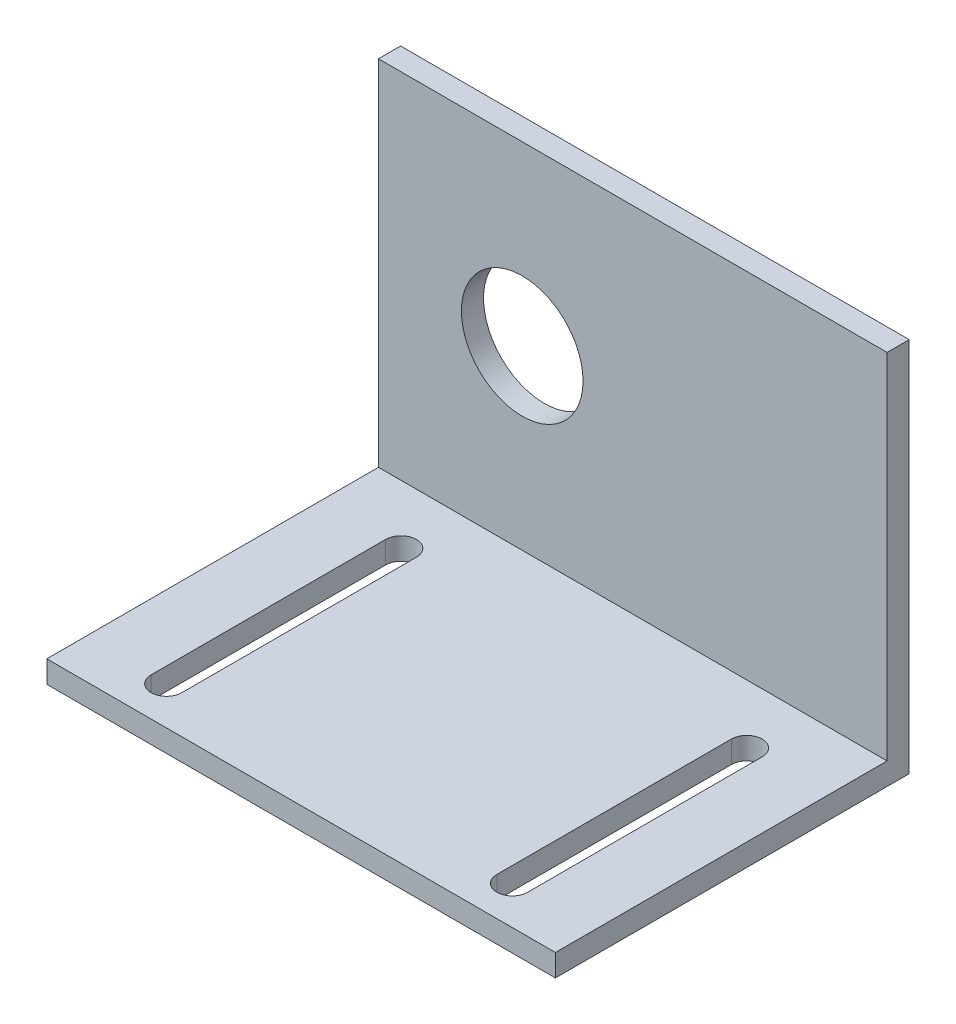
ISO-10303-21;
HEADER;
FILE_DESCRIPTION(('STEP AP214'),'2;1');
FILE_NAME('part.step','',(''),(''),'','','');
FILE_SCHEMA(('AUTOMOTIVE_DESIGN { 1 0 10303 214 1 1 1 1 }'));
ENDSEC;
DATA;
#1=APPLICATION_CONTEXT('core data for automotive mechanical design processes');
#2=APPLICATION_PROTOCOL_DEFINITION('international standard','automotive_design',2000,#1);
#3=PRODUCT_CONTEXT('',#1,'mechanical');
#4=PRODUCT('Part','Part','',(#3));
#5=PRODUCT_RELATED_PRODUCT_CATEGORY('part','',(#4));
#6=PRODUCT_DEFINITION_FORMATION('','',#4);
#7=PRODUCT_DEFINITION_CONTEXT('part definition',#1,'design');
#8=PRODUCT_DEFINITION('design','',#6,#7);
#9=PRODUCT_DEFINITION_SHAPE('','',#8);
#10=(LENGTH_UNIT() NAMED_UNIT(*) SI_UNIT(.MILLI.,.METRE.));
#11=(NAMED_UNIT(*) PLANE_ANGLE_UNIT() SI_UNIT($,.RADIAN.));
#12=(NAMED_UNIT(*) SI_UNIT($,.STERADIAN.) SOLID_ANGLE_UNIT());
#13=UNCERTAINTY_MEASURE_WITH_UNIT(LENGTH_MEASURE(1.E-05),#10,'distance_accuracy_value','');
#14=(GEOMETRIC_REPRESENTATION_CONTEXT(3) GLOBAL_UNCERTAINTY_ASSIGNED_CONTEXT((#13)) GLOBAL_UNIT_ASSIGNED_CONTEXT((#10,
#11,#12)) REPRESENTATION_CONTEXT('',''));
#15=CARTESIAN_POINT('',(0.,0.,0.));
#16=DIRECTION('',(0.,0.,1.));
#17=DIRECTION('',(1.,0.,0.));
#18=AXIS2_PLACEMENT_3D('',#15,#16,#17);
#19=CARTESIAN_POINT('',(15.7937241394591,34.,2.));
#20=DIRECTION('',(0.,-1.,0.));
#21=DIRECTION('',(0.,0.,-1.));
#22=AXIS2_PLACEMENT_3D('',#19,#20,#21);
#23=PLANE('',#22);
#24=DIRECTION('',(-1.,0.,0.));
#25=VECTOR('',#24,1.);
#26=CARTESIAN_POINT('',(15.7937241394591,34.,0.));
#27=LINE('',#26,#25);
#28=CARTESIAN_POINT('',(15.7937241394591,34.,0.));
#29=VERTEX_POINT('',#28);
#30=CARTESIAN_POINT('',(-30.2062758605409,34.,0.));
#31=VERTEX_POINT('',#30);
#32=EDGE_CURVE('E230',#29,#31,#27,.T.);
#33=ORIENTED_EDGE('',*,*,#32,.T.);
#34=DIRECTION('',(0.,0.,-1.));
#35=VECTOR('',#34,1.);
#36=CARTESIAN_POINT('',(-30.2062758605409,34.,2.));
#37=LINE('',#36,#35);
#38=CARTESIAN_POINT('',(-30.2062758605409,34.,2.));
#39=VERTEX_POINT('',#38);
#40=EDGE_CURVE('E11',#39,#31,#37,.T.);
#41=ORIENTED_EDGE('',*,*,#40,.F.);
#42=DIRECTION('',(-1.,0.,0.));
#43=VECTOR('',#42,1.);
#44=CARTESIAN_POINT('',(15.7937241394591,34.,2.));
#45=LINE('',#44,#43);
#46=CARTESIAN_POINT('',(15.7937241394591,34.,2.));
#47=VERTEX_POINT('',#46);
#48=EDGE_CURVE('E231',#47,#39,#45,.T.);
#49=ORIENTED_EDGE('',*,*,#48,.F.);
#50=DIRECTION('',(0.,0.,-1.));
#51=VECTOR('',#50,1.);
#52=CARTESIAN_POINT('',(15.7937241394591,34.,2.));
#53=LINE('',#52,#51);
#54=EDGE_CURVE('E239',#47,#29,#53,.T.);
#55=ORIENTED_EDGE('',*,*,#54,.T.);
#56=EDGE_LOOP('',(#33,#41,#49,#55));
#57=FACE_BOUND('',#56,.T.);
#58=ADVANCED_FACE('F35',(#57),#23,.F.);
#59=CARTESIAN_POINT('',(-30.2062758605409,34.,2.));
#60=DIRECTION('',(1.,0.,0.));
#61=DIRECTION('',(0.,0.,-1.));
#62=AXIS2_PLACEMENT_3D('',#59,#60,#61);
#63=PLANE('',#62);
#64=DIRECTION('',(0.,-1.,0.));
#65=VECTOR('',#64,1.);
#66=CARTESIAN_POINT('',(-30.2062758605409,34.,0.));
#67=LINE('',#66,#65);
#68=CARTESIAN_POINT('',(-30.2062758605409,0.,0.));
#69=VERTEX_POINT('',#68);
#70=EDGE_CURVE('E242',#31,#69,#67,.T.);
#71=ORIENTED_EDGE('',*,*,#70,.T.);
#72=DIRECTION('',(0.,0.,-1.));
#73=VECTOR('',#72,1.);
#74=CARTESIAN_POINT('',(-30.2062758605409,0.,2.));
#75=LINE('',#74,#73);
#76=CARTESIAN_POINT('',(-30.2062758605409,0.,32.));
#77=VERTEX_POINT('',#76);
#78=EDGE_CURVE('E42',#77,#69,#75,.T.);
#79=ORIENTED_EDGE('',*,*,#78,.F.);
#80=DIRECTION('',(0.,-1.,0.));
#81=VECTOR('',#80,1.);
#82=CARTESIAN_POINT('',(-30.2062758605409,0.,32.));
#83=LINE('',#82,#81);
#84=CARTESIAN_POINT('',(-30.2062758605409,2.,32.));
#85=VERTEX_POINT('',#84);
#86=EDGE_CURVE('E219',#85,#77,#83,.T.);
#87=ORIENTED_EDGE('',*,*,#86,.F.);
#88=DIRECTION('',(0.,0.,-1.));
#89=VECTOR('',#88,1.);
#90=CARTESIAN_POINT('',(-30.2062758605409,2.,32.));
#91=LINE('',#90,#89);
#92=CARTESIAN_POINT('',(-30.2062758605409,2.,2.));
#93=VERTEX_POINT('',#92);
#94=EDGE_CURVE('E222',#85,#93,#91,.T.);
#95=ORIENTED_EDGE('',*,*,#94,.T.);
#96=DIRECTION('',(0.,-1.,0.));
#97=VECTOR('',#96,1.);
#98=CARTESIAN_POINT('',(-30.2062758605409,34.,2.));
#99=LINE('',#98,#97);
#100=EDGE_CURVE('E234',#39,#93,#99,.T.);
#101=ORIENTED_EDGE('',*,*,#100,.F.);
#102=ORIENTED_EDGE('',*,*,#40,.T.);
#103=EDGE_LOOP('',(#71,#79,#87,#95,#101,#102));
#104=FACE_BOUND('',#103,.T.);
#105=ADVANCED_FACE('F278',(#104),#63,.F.);
#106=CARTESIAN_POINT('',(-30.2062758605409,0.,2.));
#107=DIRECTION('',(0.,1.,0.));
#108=DIRECTION('',(0.,0.,1.));
#109=AXIS2_PLACEMENT_3D('',#106,#107,#108);
#110=PLANE('',#109);
#111=DIRECTION('',(0.,0.,-1.));
#112=VECTOR('',#111,1.);
#113=CARTESIAN_POINT('',(-21.447575648557,0.,7.3283434429674));
#114=LINE('',#113,#112);
#115=CARTESIAN_POINT('',(-21.447575648557,0.,28.5399531080355));
#116=VERTEX_POINT('',#115);
#117=CARTESIAN_POINT('',(-21.447575648557,0.,7.3283434429674));
#118=VERTEX_POINT('',#117);
#119=EDGE_CURVE('E147',#116,#118,#114,.T.);
#120=ORIENTED_EDGE('',*,*,#119,.T.);
#121=CARTESIAN_POINT('',(-22.8416376239674,0.,7.3283434429674));
#122=DIRECTION('',(0.,1.,0.));
#123=DIRECTION('',(0.,0.,1.));
#124=AXIS2_PLACEMENT_3D('',#121,#122,#123);
#125=CIRCLE('',#124,1.3940619754104);
#126=CARTESIAN_POINT('',(-24.2356995993778,0.,7.3283434429674));
#127=VERTEX_POINT('',#126);
#128=EDGE_CURVE('E139',#118,#127,#125,.T.);
#129=ORIENTED_EDGE('',*,*,#128,.T.);
#130=DIRECTION('',(0.,0.,1.));
#131=VECTOR('',#130,1.);
#132=CARTESIAN_POINT('',(-24.2356995993778,0.,7.3283434429674));
#133=LINE('',#132,#131);
#134=CARTESIAN_POINT('',(-24.2356995993778,0.,28.5399531080355));
#135=VERTEX_POINT('',#134);
#136=EDGE_CURVE('E150',#127,#135,#133,.T.);
#137=ORIENTED_EDGE('',*,*,#136,.T.);
#138=CARTESIAN_POINT('',(-22.8416376239674,0.,28.5399531080355));
#139=DIRECTION('',(0.,1.,0.));
#140=DIRECTION('',(0.,0.,1.));
#141=AXIS2_PLACEMENT_3D('',#138,#139,#140);
#142=CIRCLE('',#141,1.3940619754104);
#143=EDGE_CURVE('E49',#135,#116,#142,.T.);
#144=ORIENTED_EDGE('',*,*,#143,.T.);
#145=EDGE_LOOP('',(#120,#129,#137,#144));
#146=FACE_BOUND('',#145,.T.);
#147=DIRECTION('',(0.,0.,1.));
#148=VECTOR('',#147,1.);
#149=CARTESIAN_POINT('',(7.03502392747519,0.,7.3283434429674));
#150=LINE('',#149,#148);
#151=CARTESIAN_POINT('',(7.03502392747519,0.,7.3283434429674));
#152=VERTEX_POINT('',#151);
#153=CARTESIAN_POINT('',(7.03502392747519,0.,28.5399531080355));
#154=VERTEX_POINT('',#153);
#155=EDGE_CURVE('E185',#152,#154,#150,.T.);
#156=ORIENTED_EDGE('',*,*,#155,.T.);
#157=CARTESIAN_POINT('',(8.42908590288559,0.,28.5399531080355));
#158=DIRECTION('',(0.,1.,0.));
#159=DIRECTION('',(0.,0.,-1.));
#160=AXIS2_PLACEMENT_3D('',#157,#158,#159);
#161=CIRCLE('',#160,1.3940619754104);
#162=CARTESIAN_POINT('',(9.823147878296,0.,28.5399531080355));
#163=VERTEX_POINT('',#162);
#164=EDGE_CURVE('E177',#154,#163,#161,.T.);
#165=ORIENTED_EDGE('',*,*,#164,.T.);
#166=DIRECTION('',(0.,0.,-1.));
#167=VECTOR('',#166,1.);
#168=CARTESIAN_POINT('',(9.823147878296,0.,7.3283434429674));
#169=LINE('',#168,#167);
#170=CARTESIAN_POINT('',(9.823147878296,0.,7.3283434429674));
#171=VERTEX_POINT('',#170);
#172=EDGE_CURVE('E180',#163,#171,#169,.T.);
#173=ORIENTED_EDGE('',*,*,#172,.T.);
#174=CARTESIAN_POINT('',(8.42908590288559,0.,7.3283434429674));
#175=DIRECTION('',(0.,1.,0.));
#176=DIRECTION('',(0.,0.,-1.));
#177=AXIS2_PLACEMENT_3D('',#174,#175,#176);
#178=CIRCLE('',#177,1.3940619754104);
#179=EDGE_CURVE('E57',#171,#152,#178,.T.);
#180=ORIENTED_EDGE('',*,*,#179,.T.);
#181=EDGE_LOOP('',(#156,#165,#173,#180));
#182=FACE_BOUND('',#181,.T.);
#183=DIRECTION('',(1.,0.,0.));
#184=VECTOR('',#183,1.);
#185=CARTESIAN_POINT('',(-30.2062758605409,0.,0.));
#186=LINE('',#185,#184);
#187=CARTESIAN_POINT('',(15.7937241394591,0.,0.));
#188=VERTEX_POINT('',#187);
#189=EDGE_CURVE('E244',#69,#188,#186,.T.);
#190=ORIENTED_EDGE('',*,*,#189,.T.);
#191=DIRECTION('',(0.,0.,-1.));
#192=VECTOR('',#191,1.);
#193=CARTESIAN_POINT('',(15.7937241394591,0.,2.));
#194=LINE('',#193,#192);
#195=CARTESIAN_POINT('',(15.7937241394591,0.,32.));
#196=VERTEX_POINT('',#195);
#197=EDGE_CURVE('E249',#196,#188,#194,.T.);
#198=ORIENTED_EDGE('',*,*,#197,.F.);
#199=DIRECTION('',(1.,0.,0.));
#200=VECTOR('',#199,1.);
#201=CARTESIAN_POINT('',(15.7937241394591,0.,32.));
#202=LINE('',#201,#200);
#203=EDGE_CURVE('E212',#77,#196,#202,.T.);
#204=ORIENTED_EDGE('',*,*,#203,.F.);
#205=ORIENTED_EDGE('',*,*,#78,.T.);
#206=EDGE_LOOP('',(#190,#198,#204,#205));
#207=FACE_BOUND('',#206,.T.);
#208=ADVANCED_FACE('F154',(#146,#182,#207),#110,.F.);
#209=CARTESIAN_POINT('',(15.7937241394591,0.,2.));
#210=DIRECTION('',(-1.,0.,0.));
#211=DIRECTION('',(0.,0.,1.));
#212=AXIS2_PLACEMENT_3D('',#209,#210,#211);
#213=PLANE('',#212);
#214=DIRECTION('',(0.,1.,0.));
#215=VECTOR('',#214,1.);
#216=CARTESIAN_POINT('',(15.7937241394591,0.,0.));
#217=LINE('',#216,#215);
#218=EDGE_CURVE('E235',#188,#29,#217,.T.);
#219=ORIENTED_EDGE('',*,*,#218,.T.);
#220=ORIENTED_EDGE('',*,*,#54,.F.);
#221=DIRECTION('',(0.,1.,0.));
#222=VECTOR('',#221,1.);
#223=CARTESIAN_POINT('',(15.7937241394591,0.,2.));
#224=LINE('',#223,#222);
#225=CARTESIAN_POINT('',(15.7937241394591,2.,2.));
#226=VERTEX_POINT('',#225);
#227=EDGE_CURVE('E237',#226,#47,#224,.T.);
#228=ORIENTED_EDGE('',*,*,#227,.F.);
#229=DIRECTION('',(0.,0.,-1.));
#230=VECTOR('',#229,1.);
#231=CARTESIAN_POINT('',(15.7937241394591,2.,32.));
#232=LINE('',#231,#230);
#233=CARTESIAN_POINT('',(15.7937241394591,2.,32.));
#234=VERTEX_POINT('',#233);
#235=EDGE_CURVE('E227',#234,#226,#232,.T.);
#236=ORIENTED_EDGE('',*,*,#235,.F.);
#237=DIRECTION('',(0.,1.,0.));
#238=VECTOR('',#237,1.);
#239=CARTESIAN_POINT('',(15.7937241394591,2.,32.));
#240=LINE('',#239,#238);
#241=EDGE_CURVE('E215',#196,#234,#240,.T.);
#242=ORIENTED_EDGE('',*,*,#241,.F.);
#243=ORIENTED_EDGE('',*,*,#197,.T.);
#244=EDGE_LOOP('',(#219,#220,#228,#236,#242,#243));
#245=FACE_BOUND('',#244,.T.);
#246=ADVANCED_FACE('F263',(#245),#213,.F.);
#247=CARTESIAN_POINT('',(0.,0.,2.));
#248=DIRECTION('',(0.,0.,1.));
#249=DIRECTION('',(1.,0.,0.));
#250=AXIS2_PLACEMENT_3D('',#247,#248,#249);
#251=PLANE('',#250);
#252=CARTESIAN_POINT('',(-17.2062758605409,18.,2.));
#253=DIRECTION('',(0.,0.,1.));
#254=DIRECTION('',(1.,0.,0.));
#255=AXIS2_PLACEMENT_3D('',#252,#253,#254);
#256=CIRCLE('',#255,5.5);
#257=CARTESIAN_POINT('',(-11.7062758605409,18.,2.));
#258=VERTEX_POINT('',#257);
#259=EDGE_CURVE('E173',#258,#258,#256,.T.);
#260=ORIENTED_EDGE('',*,*,#259,.F.);
#261=EDGE_LOOP('',(#260));
#262=FACE_BOUND('',#261,.T.);
#263=DIRECTION('',(-1.,0.,0.));
#264=VECTOR('',#263,1.);
#265=CARTESIAN_POINT('',(-30.2062758605409,2.,2.));
#266=LINE('',#265,#264);
#267=EDGE_CURVE('E209',#226,#93,#266,.T.);
#268=ORIENTED_EDGE('',*,*,#267,.F.);
#269=ORIENTED_EDGE('',*,*,#227,.T.);
#270=ORIENTED_EDGE('',*,*,#48,.T.);
#271=ORIENTED_EDGE('',*,*,#100,.T.);
#272=EDGE_LOOP('',(#268,#269,#270,#271));
#273=FACE_BOUND('',#272,.T.);
#274=ADVANCED_FACE('F270',(#262,#273),#251,.T.);
#275=CARTESIAN_POINT('',(0.,0.,0.));
#276=DIRECTION('',(0.,0.,1.));
#277=DIRECTION('',(1.,0.,0.));
#278=AXIS2_PLACEMENT_3D('',#275,#276,#277);
#279=PLANE('',#278);
#280=CARTESIAN_POINT('',(-17.2062758605409,18.,0.));
#281=DIRECTION('',(0.,0.,1.));
#282=DIRECTION('',(1.,0.,0.));
#283=AXIS2_PLACEMENT_3D('',#280,#281,#282);
#284=CIRCLE('',#283,5.5);
#285=CARTESIAN_POINT('',(-11.7062758605409,18.,0.));
#286=VERTEX_POINT('',#285);
#287=EDGE_CURVE('E206',#286,#286,#284,.T.);
#288=ORIENTED_EDGE('',*,*,#287,.T.);
#289=EDGE_LOOP('',(#288));
#290=FACE_BOUND('',#289,.T.);
#291=ORIENTED_EDGE('',*,*,#32,.F.);
#292=ORIENTED_EDGE('',*,*,#218,.F.);
#293=ORIENTED_EDGE('',*,*,#189,.F.);
#294=ORIENTED_EDGE('',*,*,#70,.F.);
#295=EDGE_LOOP('',(#291,#292,#293,#294));
#296=FACE_BOUND('',#295,.T.);
#297=ADVANCED_FACE('F260',(#290,#296),#279,.F.);
#298=CARTESIAN_POINT('',(-30.2062758605409,2.,32.));
#299=DIRECTION('',(0.,-1.,0.));
#300=DIRECTION('',(0.,0.,-1.));
#301=AXIS2_PLACEMENT_3D('',#298,#299,#300);
#302=PLANE('',#301);
#303=DIRECTION('',(0.,0.,1.));
#304=VECTOR('',#303,1.);
#305=CARTESIAN_POINT('',(-24.2356995993778,2.,7.3283434429674));
#306=LINE('',#305,#304);
#307=CARTESIAN_POINT('',(-24.2356995993778,2.,7.3283434429674));
#308=VERTEX_POINT('',#307);
#309=CARTESIAN_POINT('',(-24.2356995993778,2.,28.5399531080355));
#310=VERTEX_POINT('',#309);
#311=EDGE_CURVE('E166',#308,#310,#306,.T.);
#312=ORIENTED_EDGE('',*,*,#311,.F.);
#313=CARTESIAN_POINT('',(-22.8416376239674,2.,7.3283434429674));
#314=DIRECTION('',(0.,1.,0.));
#315=DIRECTION('',(0.,0.,1.));
#316=AXIS2_PLACEMENT_3D('',#313,#314,#315);
#317=CIRCLE('',#316,1.3940619754104);
#318=CARTESIAN_POINT('',(-21.447575648557,2.,7.3283434429674));
#319=VERTEX_POINT('',#318);
#320=EDGE_CURVE('E142',#319,#308,#317,.T.);
#321=ORIENTED_EDGE('',*,*,#320,.F.);
#322=DIRECTION('',(0.,0.,-1.));
#323=VECTOR('',#322,1.);
#324=CARTESIAN_POINT('',(-21.447575648557,2.,7.3283434429674));
#325=LINE('',#324,#323);
#326=CARTESIAN_POINT('',(-21.447575648557,2.,28.5399531080355));
#327=VERTEX_POINT('',#326);
#328=EDGE_CURVE('E157',#327,#319,#325,.T.);
#329=ORIENTED_EDGE('',*,*,#328,.F.);
#330=CARTESIAN_POINT('',(-22.8416376239674,2.,28.5399531080355));
#331=DIRECTION('',(0.,1.,0.));
#332=DIRECTION('',(0.,0.,1.));
#333=AXIS2_PLACEMENT_3D('',#330,#331,#332);
#334=CIRCLE('',#333,1.3940619754104);
#335=EDGE_CURVE('E160',#310,#327,#334,.T.);
#336=ORIENTED_EDGE('',*,*,#335,.F.);
#337=EDGE_LOOP('',(#312,#321,#329,#336));
#338=FACE_BOUND('',#337,.T.);
#339=DIRECTION('',(0.,0.,-1.));
#340=VECTOR('',#339,1.);
#341=CARTESIAN_POINT('',(9.823147878296,2.,7.3283434429674));
#342=LINE('',#341,#340);
#343=CARTESIAN_POINT('',(9.823147878296,2.,28.5399531080355));
#344=VERTEX_POINT('',#343);
#345=CARTESIAN_POINT('',(9.823147878296,2.,7.3283434429674));
#346=VERTEX_POINT('',#345);
#347=EDGE_CURVE('E191',#344,#346,#342,.T.);
#348=ORIENTED_EDGE('',*,*,#347,.F.);
#349=CARTESIAN_POINT('',(8.42908590288559,2.,28.5399531080355));
#350=DIRECTION('',(0.,1.,0.));
#351=DIRECTION('',(0.,0.,-1.));
#352=AXIS2_PLACEMENT_3D('',#349,#350,#351);
#353=CIRCLE('',#352,1.3940619754104);
#354=CARTESIAN_POINT('',(7.03502392747519,2.,28.5399531080355));
#355=VERTEX_POINT('',#354);
#356=EDGE_CURVE('E189',#355,#344,#353,.T.);
#357=ORIENTED_EDGE('',*,*,#356,.F.);
#358=DIRECTION('',(0.,0.,1.));
#359=VECTOR('',#358,1.);
#360=CARTESIAN_POINT('',(7.03502392747519,2.,7.3283434429674));
#361=LINE('',#360,#359);
#362=CARTESIAN_POINT('',(7.03502392747519,2.,7.3283434429674));
#363=VERTEX_POINT('',#362);
#364=EDGE_CURVE('E181',#363,#355,#361,.T.);
#365=ORIENTED_EDGE('',*,*,#364,.F.);
#366=CARTESIAN_POINT('',(8.42908590288559,2.,7.3283434429674));
#367=DIRECTION('',(0.,1.,0.));
#368=DIRECTION('',(0.,0.,-1.));
#369=AXIS2_PLACEMENT_3D('',#366,#367,#368);
#370=CIRCLE('',#369,1.3940619754104);
#371=EDGE_CURVE('E194',#346,#363,#370,.T.);
#372=ORIENTED_EDGE('',*,*,#371,.F.);
#373=EDGE_LOOP('',(#348,#357,#365,#372));
#374=FACE_BOUND('',#373,.T.);
#375=ORIENTED_EDGE('',*,*,#267,.T.);
#376=ORIENTED_EDGE('',*,*,#94,.F.);
#377=DIRECTION('',(-1.,0.,0.));
#378=VECTOR('',#377,1.);
#379=CARTESIAN_POINT('',(-30.2062758605409,2.,32.));
#380=LINE('',#379,#378);
#381=EDGE_CURVE('E217',#234,#85,#380,.T.);
#382=ORIENTED_EDGE('',*,*,#381,.F.);
#383=ORIENTED_EDGE('',*,*,#235,.T.);
#384=EDGE_LOOP('',(#375,#376,#382,#383));
#385=FACE_BOUND('',#384,.T.);
#386=ADVANCED_FACE('F274',(#338,#374,#385),#302,.F.);
#387=CARTESIAN_POINT('',(0.,0.,32.));
#388=DIRECTION('',(0.,0.,-1.));
#389=DIRECTION('',(-1.,0.,0.));
#390=AXIS2_PLACEMENT_3D('',#387,#388,#389);
#391=PLANE('',#390);
#392=ORIENTED_EDGE('',*,*,#203,.T.);
#393=ORIENTED_EDGE('',*,*,#241,.T.);
#394=ORIENTED_EDGE('',*,*,#381,.T.);
#395=ORIENTED_EDGE('',*,*,#86,.T.);
#396=EDGE_LOOP('',(#392,#393,#394,#395));
#397=FACE_BOUND('',#396,.T.);
#398=ADVANCED_FACE('F277',(#397),#391,.F.);
#399=CARTESIAN_POINT('',(-17.2062758605409,18.,0.));
#400=DIRECTION('',(0.,0.,1.));
#401=DIRECTION('',(1.,0.,0.));
#402=AXIS2_PLACEMENT_3D('',#399,#400,#401);
#403=CYLINDRICAL_SURFACE('',#402,5.5);
#404=ORIENTED_EDGE('',*,*,#287,.F.);
#405=EDGE_LOOP('',(#404));
#406=FACE_BOUND('',#405,.T.);
#407=ORIENTED_EDGE('',*,*,#259,.T.);
#408=EDGE_LOOP('',(#407));
#409=FACE_BOUND('',#408,.T.);
#410=ADVANCED_FACE('F299',(#406,#409),#403,.F.);
#411=CARTESIAN_POINT('',(8.42908590288559,0.,28.5399531080355));
#412=DIRECTION('',(0.,1.,0.));
#413=DIRECTION('',(0.,0.,1.));
#414=AXIS2_PLACEMENT_3D('',#411,#412,#413);
#415=CYLINDRICAL_SURFACE('',#414,1.3940619754104);
#416=ORIENTED_EDGE('',*,*,#356,.T.);
#417=DIRECTION('',(0.,1.,0.));
#418=VECTOR('',#417,1.);
#419=CARTESIAN_POINT('',(9.823147878296,0.,28.5399531080355));
#420=LINE('',#419,#418);
#421=EDGE_CURVE('E188',#163,#344,#420,.T.);
#422=ORIENTED_EDGE('',*,*,#421,.F.);
#423=ORIENTED_EDGE('',*,*,#164,.F.);
#424=DIRECTION('',(0.,1.,0.));
#425=VECTOR('',#424,1.);
#426=CARTESIAN_POINT('',(7.03502392747519,0.,28.5399531080355));
#427=LINE('',#426,#425);
#428=EDGE_CURVE('E167',#154,#355,#427,.T.);
#429=ORIENTED_EDGE('',*,*,#428,.T.);
#430=EDGE_LOOP('',(#416,#422,#423,#429));
#431=FACE_BOUND('',#430,.T.);
#432=ADVANCED_FACE('F302',(#431),#415,.F.);
#433=CARTESIAN_POINT('',(7.03502392747519,0.,7.3283434429674));
#434=DIRECTION('',(-1.,0.,0.));
#435=DIRECTION('',(0.,0.,1.));
#436=AXIS2_PLACEMENT_3D('',#433,#434,#435);
#437=PLANE('',#436);
#438=ORIENTED_EDGE('',*,*,#364,.T.);
#439=ORIENTED_EDGE('',*,*,#428,.F.);
#440=ORIENTED_EDGE('',*,*,#155,.F.);
#441=DIRECTION('',(0.,1.,0.));
#442=VECTOR('',#441,1.);
#443=CARTESIAN_POINT('',(7.03502392747519,0.,7.3283434429674));
#444=LINE('',#443,#442);
#445=EDGE_CURVE('E200',#152,#363,#444,.T.);
#446=ORIENTED_EDGE('',*,*,#445,.T.);
#447=EDGE_LOOP('',(#438,#439,#440,#446));
#448=FACE_BOUND('',#447,.T.);
#449=ADVANCED_FACE('F306',(#448),#437,.F.);
#450=CARTESIAN_POINT('',(8.42908590288559,0.,7.3283434429674));
#451=DIRECTION('',(0.,1.,0.));
#452=DIRECTION('',(0.,0.,1.));
#453=AXIS2_PLACEMENT_3D('',#450,#451,#452);
#454=CYLINDRICAL_SURFACE('',#453,1.3940619754104);
#455=ORIENTED_EDGE('',*,*,#371,.T.);
#456=ORIENTED_EDGE('',*,*,#445,.F.);
#457=ORIENTED_EDGE('',*,*,#179,.F.);
#458=DIRECTION('',(0.,1.,0.));
#459=VECTOR('',#458,1.);
#460=CARTESIAN_POINT('',(9.823147878296,0.,7.3283434429674));
#461=LINE('',#460,#459);
#462=EDGE_CURVE('E202',#171,#346,#461,.T.);
#463=ORIENTED_EDGE('',*,*,#462,.T.);
#464=EDGE_LOOP('',(#455,#456,#457,#463));
#465=FACE_BOUND('',#464,.T.);
#466=ADVANCED_FACE('F311',(#465),#454,.F.);
#467=CARTESIAN_POINT('',(9.823147878296,0.,7.3283434429674));
#468=DIRECTION('',(1.,0.,0.));
#469=DIRECTION('',(0.,0.,-1.));
#470=AXIS2_PLACEMENT_3D('',#467,#468,#469);
#471=PLANE('',#470);
#472=ORIENTED_EDGE('',*,*,#347,.T.);
#473=ORIENTED_EDGE('',*,*,#462,.F.);
#474=ORIENTED_EDGE('',*,*,#172,.F.);
#475=ORIENTED_EDGE('',*,*,#421,.T.);
#476=EDGE_LOOP('',(#472,#473,#474,#475));
#477=FACE_BOUND('',#476,.T.);
#478=ADVANCED_FACE('F308',(#477),#471,.F.);
#479=CARTESIAN_POINT('',(-22.8416376239674,0.,7.3283434429674));
#480=DIRECTION('',(0.,1.,0.));
#481=DIRECTION('',(0.,0.,1.));
#482=AXIS2_PLACEMENT_3D('',#479,#480,#481);
#483=CYLINDRICAL_SURFACE('',#482,1.3940619754104);
#484=ORIENTED_EDGE('',*,*,#320,.T.);
#485=DIRECTION('',(0.,1.,0.));
#486=VECTOR('',#485,1.);
#487=CARTESIAN_POINT('',(-24.2356995993778,0.,7.3283434429674));
#488=LINE('',#487,#486);
#489=EDGE_CURVE('E135',#127,#308,#488,.T.);
#490=ORIENTED_EDGE('',*,*,#489,.F.);
#491=ORIENTED_EDGE('',*,*,#128,.F.);
#492=DIRECTION('',(0.,1.,0.));
#493=VECTOR('',#492,1.);
#494=CARTESIAN_POINT('',(-21.447575648557,0.,7.3283434429674));
#495=LINE('',#494,#493);
#496=EDGE_CURVE('E171',#118,#319,#495,.T.);
#497=ORIENTED_EDGE('',*,*,#496,.T.);
#498=EDGE_LOOP('',(#484,#490,#491,#497));
#499=FACE_BOUND('',#498,.T.);
#500=ADVANCED_FACE('F137',(#499),#483,.F.);
#501=CARTESIAN_POINT('',(-21.447575648557,0.,7.3283434429674));
#502=DIRECTION('',(1.,0.,0.));
#503=DIRECTION('',(0.,0.,-1.));
#504=AXIS2_PLACEMENT_3D('',#501,#502,#503);
#505=PLANE('',#504);
#506=ORIENTED_EDGE('',*,*,#328,.T.);
#507=ORIENTED_EDGE('',*,*,#496,.F.);
#508=ORIENTED_EDGE('',*,*,#119,.F.);
#509=DIRECTION('',(0.,1.,0.));
#510=VECTOR('',#509,1.);
#511=CARTESIAN_POINT('',(-21.447575648557,0.,28.5399531080355));
#512=LINE('',#511,#510);
#513=EDGE_CURVE('E174',#116,#327,#512,.T.);
#514=ORIENTED_EDGE('',*,*,#513,.T.);
#515=EDGE_LOOP('',(#506,#507,#508,#514));
#516=FACE_BOUND('',#515,.T.);
#517=ADVANCED_FACE('F320',(#516),#505,.F.);
#518=CARTESIAN_POINT('',(-22.8416376239674,0.,28.5399531080355));
#519=DIRECTION('',(0.,1.,0.));
#520=DIRECTION('',(0.,0.,1.));
#521=AXIS2_PLACEMENT_3D('',#518,#519,#520);
#522=CYLINDRICAL_SURFACE('',#521,1.3940619754104);
#523=ORIENTED_EDGE('',*,*,#335,.T.);
#524=ORIENTED_EDGE('',*,*,#513,.F.);
#525=ORIENTED_EDGE('',*,*,#143,.F.);
#526=DIRECTION('',(0.,1.,0.));
#527=VECTOR('',#526,1.);
#528=CARTESIAN_POINT('',(-24.2356995993778,0.,28.5399531080355));
#529=LINE('',#528,#527);
#530=EDGE_CURVE('E146',#135,#310,#529,.T.);
#531=ORIENTED_EDGE('',*,*,#530,.T.);
#532=EDGE_LOOP('',(#523,#524,#525,#531));
#533=FACE_BOUND('',#532,.T.);
#534=ADVANCED_FACE('F323',(#533),#522,.F.);
#535=CARTESIAN_POINT('',(-24.2356995993778,0.,7.3283434429674));
#536=DIRECTION('',(-1.,0.,0.));
#537=DIRECTION('',(0.,0.,1.));
#538=AXIS2_PLACEMENT_3D('',#535,#536,#537);
#539=PLANE('',#538);
#540=ORIENTED_EDGE('',*,*,#311,.T.);
#541=ORIENTED_EDGE('',*,*,#530,.F.);
#542=ORIENTED_EDGE('',*,*,#136,.F.);
#543=ORIENTED_EDGE('',*,*,#489,.T.);
#544=EDGE_LOOP('',(#540,#541,#542,#543));
#545=FACE_BOUND('',#544,.T.);
#546=ADVANCED_FACE('F151',(#545),#539,.F.);
#547=CLOSED_SHELL('',(#58,#105,#208,#246,#274,#297,#386,#398,#410,#432,#449,#466,#478,#500,#517,
#534,#546));
#548=MANIFOLD_SOLID_BREP('B2',#547);
#549=ADVANCED_BREP_SHAPE_REPRESENTATION('',(#18,#548),#14);
#550=SHAPE_DEFINITION_REPRESENTATION(#9,#549);
ENDSEC;
END-ISO-10303-21;
